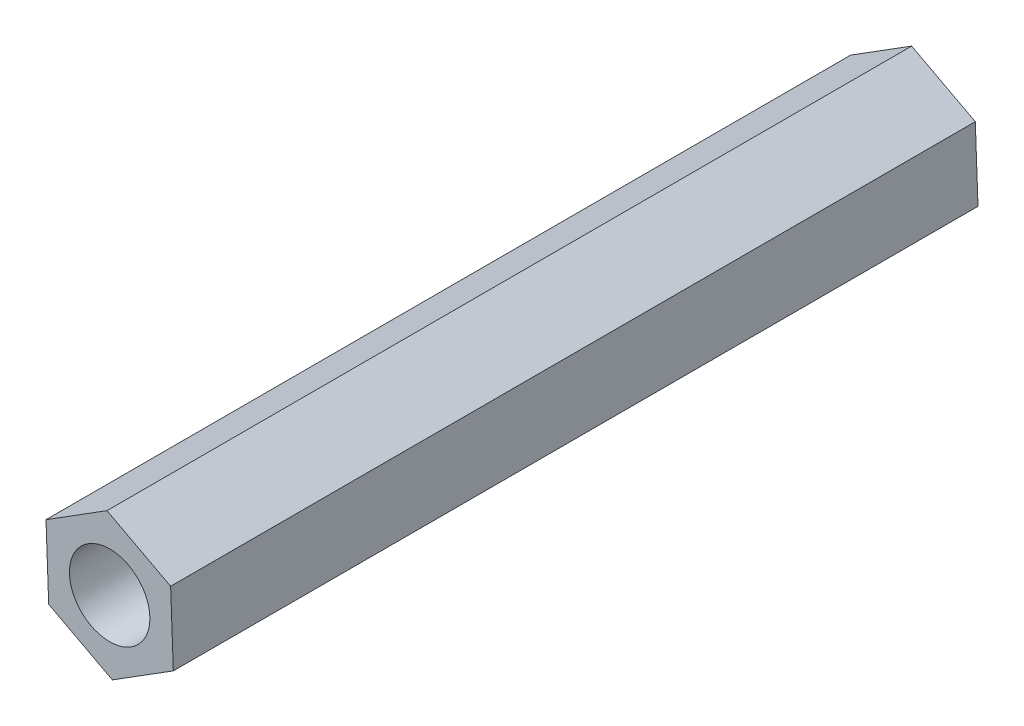
ISO-10303-21;
HEADER;
FILE_DESCRIPTION(('STEP AP214'),'2;1');
FILE_NAME('part.step','',(''),(''),'','','');
FILE_SCHEMA(('AUTOMOTIVE_DESIGN { 1 0 10303 214 1 1 1 1 }'));
ENDSEC;
DATA;
#1=APPLICATION_CONTEXT('core data for automotive mechanical design processes');
#2=APPLICATION_PROTOCOL_DEFINITION('international standard','automotive_design',2000,#1);
#3=PRODUCT_CONTEXT('',#1,'mechanical');
#4=PRODUCT('Part','Part','',(#3));
#5=PRODUCT_RELATED_PRODUCT_CATEGORY('part','',(#4));
#6=PRODUCT_DEFINITION_FORMATION('','',#4);
#7=PRODUCT_DEFINITION_CONTEXT('part definition',#1,'design');
#8=PRODUCT_DEFINITION('design','',#6,#7);
#9=PRODUCT_DEFINITION_SHAPE('','',#8);
#10=(LENGTH_UNIT() NAMED_UNIT(*) SI_UNIT(.MILLI.,.METRE.));
#11=(NAMED_UNIT(*) PLANE_ANGLE_UNIT() SI_UNIT($,.RADIAN.));
#12=(NAMED_UNIT(*) SI_UNIT($,.STERADIAN.) SOLID_ANGLE_UNIT());
#13=UNCERTAINTY_MEASURE_WITH_UNIT(LENGTH_MEASURE(1.E-05),#10,'distance_accuracy_value','');
#14=(GEOMETRIC_REPRESENTATION_CONTEXT(3) GLOBAL_UNCERTAINTY_ASSIGNED_CONTEXT((#13)) GLOBAL_UNIT_ASSIGNED_CONTEXT((#10,
#11,#12)) REPRESENTATION_CONTEXT('',''));
#15=CARTESIAN_POINT('',(0.,0.,0.));
#16=DIRECTION('',(0.,0.,1.));
#17=DIRECTION('',(1.,0.,0.));
#18=AXIS2_PLACEMENT_3D('',#15,#16,#17);
#19=CARTESIAN_POINT('',(0.,0.,30.));
#20=DIRECTION('',(0.,0.,1.));
#21=DIRECTION('',(1.,0.,0.));
#22=AXIS2_PLACEMENT_3D('',#19,#20,#21);
#23=PLANE('',#22);
#24=DIRECTION('',(-0.0373746720524852,0.999301322869618,0.));
#25=VECTOR('',#24,1.);
#26=CARTESIAN_POINT('',(2.37354506962798,-1.25450540152072,30.));
#27=LINE('',#26,#25);
#28=CARTESIAN_POINT('',(2.37354506962798,-1.25450540152072,30.));
#29=VERTEX_POINT('',#28);
#30=CARTESIAN_POINT('',(2.27320608171573,1.42829762656477,30.));
#31=VERTEX_POINT('',#30);
#32=EDGE_CURVE('E131',#29,#31,#27,.T.);
#33=ORIENTED_EDGE('',*,*,#32,.T.);
#34=DIRECTION('',(-0.884107667666727,0.467283245979245,0.));
#35=VECTOR('',#34,1.);
#36=CARTESIAN_POINT('',(2.27320608171573,1.42829762656477,30.));
#37=LINE('',#36,#35);
#38=CARTESIAN_POINT('',(-0.100338987912251,2.68280302808549,30.));
#39=VERTEX_POINT('',#38);
#40=EDGE_CURVE('E89',#31,#39,#37,.T.);
#41=ORIENTED_EDGE('',*,*,#40,.T.);
#42=DIRECTION('',(-0.846732995614242,-0.532018076890375,0.));
#43=VECTOR('',#42,1.);
#44=CARTESIAN_POINT('',(-0.100338987912251,2.68280302808549,30.));
#45=LINE('',#44,#43);
#46=CARTESIAN_POINT('',(-2.37354506962798,1.25450540152072,30.));
#47=VERTEX_POINT('',#46);
#48=EDGE_CURVE('E102',#39,#47,#45,.T.);
#49=ORIENTED_EDGE('',*,*,#48,.T.);
#50=DIRECTION('',(0.0373746720524864,-0.999301322869618,0.));
#51=VECTOR('',#50,1.);
#52=CARTESIAN_POINT('',(-2.37354506962798,1.25450540152072,30.));
#53=LINE('',#52,#51);
#54=CARTESIAN_POINT('',(-2.27320608171573,-1.42829762656478,30.));
#55=VERTEX_POINT('',#54);
#56=EDGE_CURVE('E96',#47,#55,#53,.T.);
#57=ORIENTED_EDGE('',*,*,#56,.T.);
#58=DIRECTION('',(0.884107667666728,-0.467283245979244,0.));
#59=VECTOR('',#58,1.);
#60=CARTESIAN_POINT('',(-2.27320608171573,-1.42829762656478,30.));
#61=LINE('',#60,#59);
#62=CARTESIAN_POINT('',(0.100338987912251,-2.68280302808549,30.));
#63=VERTEX_POINT('',#62);
#64=EDGE_CURVE('E100',#55,#63,#61,.T.);
#65=ORIENTED_EDGE('',*,*,#64,.T.);
#66=DIRECTION('',(0.846732995614242,0.532018076890374,0.));
#67=VECTOR('',#66,1.);
#68=CARTESIAN_POINT('',(0.100338987912251,-2.68280302808549,30.));
#69=LINE('',#68,#67);
#70=EDGE_CURVE('E52',#63,#29,#69,.T.);
#71=ORIENTED_EDGE('',*,*,#70,.T.);
#72=EDGE_LOOP('',(#33,#41,#49,#57,#65,#71));
#73=FACE_BOUND('',#72,.T.);
#74=CARTESIAN_POINT('',(0.,0.,30.));
#75=DIRECTION('',(0.,0.,1.));
#76=DIRECTION('',(1.,0.,0.));
#77=AXIS2_PLACEMENT_3D('',#74,#75,#76);
#78=CIRCLE('',#77,1.5);
#79=CARTESIAN_POINT('',(1.5,0.,30.));
#80=VERTEX_POINT('',#79);
#81=EDGE_CURVE('E124',#80,#80,#78,.T.);
#82=ORIENTED_EDGE('',*,*,#81,.F.);
#83=EDGE_LOOP('',(#82));
#84=FACE_BOUND('',#83,.T.);
#85=ADVANCED_FACE('F35',(#73,#84),#23,.T.);
#86=CARTESIAN_POINT('',(0.,0.,0.));
#87=DIRECTION('',(0.,0.,1.));
#88=DIRECTION('',(1.,0.,0.));
#89=AXIS2_PLACEMENT_3D('',#86,#87,#88);
#90=PLANE('',#89);
#91=DIRECTION('',(-0.0373746720524852,0.999301322869618,0.));
#92=VECTOR('',#91,1.);
#93=CARTESIAN_POINT('',(2.37354506962798,-1.25450540152072,0.));
#94=LINE('',#93,#92);
#95=CARTESIAN_POINT('',(2.37354506962798,-1.25450540152072,0.));
#96=VERTEX_POINT('',#95);
#97=CARTESIAN_POINT('',(2.27320608171573,1.42829762656477,0.));
#98=VERTEX_POINT('',#97);
#99=EDGE_CURVE('E120',#96,#98,#94,.T.);
#100=ORIENTED_EDGE('',*,*,#99,.F.);
#101=DIRECTION('',(0.846732995614242,0.532018076890374,0.));
#102=VECTOR('',#101,1.);
#103=CARTESIAN_POINT('',(0.100338987912251,-2.68280302808549,0.));
#104=LINE('',#103,#102);
#105=CARTESIAN_POINT('',(0.100338987912251,-2.68280302808549,0.));
#106=VERTEX_POINT('',#105);
#107=EDGE_CURVE('E81',#106,#96,#104,.T.);
#108=ORIENTED_EDGE('',*,*,#107,.F.);
#109=DIRECTION('',(0.884107667666728,-0.467283245979244,0.));
#110=VECTOR('',#109,1.);
#111=CARTESIAN_POINT('',(-2.27320608171573,-1.42829762656478,0.));
#112=LINE('',#111,#110);
#113=CARTESIAN_POINT('',(-2.27320608171573,-1.42829762656478,0.));
#114=VERTEX_POINT('',#113);
#115=EDGE_CURVE('E75',#114,#106,#112,.T.);
#116=ORIENTED_EDGE('',*,*,#115,.F.);
#117=DIRECTION('',(0.0373746720524864,-0.999301322869618,0.));
#118=VECTOR('',#117,1.);
#119=CARTESIAN_POINT('',(-2.37354506962798,1.25450540152072,0.));
#120=LINE('',#119,#118);
#121=CARTESIAN_POINT('',(-2.37354506962798,1.25450540152072,0.));
#122=VERTEX_POINT('',#121);
#123=EDGE_CURVE('E110',#122,#114,#120,.T.);
#124=ORIENTED_EDGE('',*,*,#123,.F.);
#125=DIRECTION('',(-0.846732995614242,-0.532018076890375,0.));
#126=VECTOR('',#125,1.);
#127=CARTESIAN_POINT('',(-0.100338987912251,2.68280302808549,0.));
#128=LINE('',#127,#126);
#129=CARTESIAN_POINT('',(-0.100338987912251,2.68280302808549,0.));
#130=VERTEX_POINT('',#129);
#131=EDGE_CURVE('E126',#130,#122,#128,.T.);
#132=ORIENTED_EDGE('',*,*,#131,.F.);
#133=DIRECTION('',(-0.884107667666727,0.467283245979245,0.));
#134=VECTOR('',#133,1.);
#135=CARTESIAN_POINT('',(2.27320608171573,1.42829762656477,0.));
#136=LINE('',#135,#134);
#137=EDGE_CURVE('E123',#98,#130,#136,.T.);
#138=ORIENTED_EDGE('',*,*,#137,.F.);
#139=EDGE_LOOP('',(#100,#108,#116,#124,#132,#138));
#140=FACE_BOUND('',#139,.T.);
#141=CARTESIAN_POINT('',(0.,0.,0.));
#142=DIRECTION('',(0.,0.,1.));
#143=DIRECTION('',(1.,0.,0.));
#144=AXIS2_PLACEMENT_3D('',#141,#142,#143);
#145=CIRCLE('',#144,1.5);
#146=CARTESIAN_POINT('',(1.5,0.,0.));
#147=VERTEX_POINT('',#146);
#148=EDGE_CURVE('E224',#147,#147,#145,.T.);
#149=ORIENTED_EDGE('',*,*,#148,.T.);
#150=EDGE_LOOP('',(#149));
#151=FACE_BOUND('',#150,.T.);
#152=ADVANCED_FACE('F140',(#140,#151),#90,.F.);
#153=CARTESIAN_POINT('',(2.37354506962798,-1.25450540152072,30.));
#154=DIRECTION('',(-0.999301322869618,-0.0373746720524852,0.));
#155=DIRECTION('',(0.0373746720524852,-0.999301322869618,0.));
#156=AXIS2_PLACEMENT_3D('',#153,#154,#155);
#157=PLANE('',#156);
#158=ORIENTED_EDGE('',*,*,#99,.T.);
#159=DIRECTION('',(0.,0.,-1.));
#160=VECTOR('',#159,1.);
#161=CARTESIAN_POINT('',(2.27320608171573,1.42829762656477,30.));
#162=LINE('',#161,#160);
#163=EDGE_CURVE('E11',#31,#98,#162,.T.);
#164=ORIENTED_EDGE('',*,*,#163,.F.);
#165=ORIENTED_EDGE('',*,*,#32,.F.);
#166=DIRECTION('',(0.,0.,-1.));
#167=VECTOR('',#166,1.);
#168=CARTESIAN_POINT('',(2.37354506962798,-1.25450540152072,30.));
#169=LINE('',#168,#167);
#170=EDGE_CURVE('E116',#29,#96,#169,.T.);
#171=ORIENTED_EDGE('',*,*,#170,.T.);
#172=EDGE_LOOP('',(#158,#164,#165,#171));
#173=FACE_BOUND('',#172,.T.);
#174=ADVANCED_FACE('F37',(#173),#157,.F.);
#175=CARTESIAN_POINT('',(2.27320608171573,1.42829762656477,30.));
#176=DIRECTION('',(-0.467283245979245,-0.884107667666727,0.));
#177=DIRECTION('',(0.884107667666727,-0.467283245979245,0.));
#178=AXIS2_PLACEMENT_3D('',#175,#176,#177);
#179=PLANE('',#178);
#180=ORIENTED_EDGE('',*,*,#137,.T.);
#181=DIRECTION('',(0.,0.,-1.));
#182=VECTOR('',#181,1.);
#183=CARTESIAN_POINT('',(-0.100338987912251,2.68280302808549,30.));
#184=LINE('',#183,#182);
#185=EDGE_CURVE('E44',#39,#130,#184,.T.);
#186=ORIENTED_EDGE('',*,*,#185,.F.);
#187=ORIENTED_EDGE('',*,*,#40,.F.);
#188=ORIENTED_EDGE('',*,*,#163,.T.);
#189=EDGE_LOOP('',(#180,#186,#187,#188));
#190=FACE_BOUND('',#189,.T.);
#191=ADVANCED_FACE('F165',(#190),#179,.F.);
#192=CARTESIAN_POINT('',(-0.100338987912251,2.68280302808549,30.));
#193=DIRECTION('',(0.532018076890375,-0.846732995614242,0.));
#194=DIRECTION('',(0.846732995614242,0.532018076890375,0.));
#195=AXIS2_PLACEMENT_3D('',#192,#193,#194);
#196=PLANE('',#195);
#197=ORIENTED_EDGE('',*,*,#131,.T.);
#198=DIRECTION('',(0.,0.,-1.));
#199=VECTOR('',#198,1.);
#200=CARTESIAN_POINT('',(-2.37354506962798,1.25450540152072,30.));
#201=LINE('',#200,#199);
#202=EDGE_CURVE('E111',#47,#122,#201,.T.);
#203=ORIENTED_EDGE('',*,*,#202,.F.);
#204=ORIENTED_EDGE('',*,*,#48,.F.);
#205=ORIENTED_EDGE('',*,*,#185,.T.);
#206=EDGE_LOOP('',(#197,#203,#204,#205));
#207=FACE_BOUND('',#206,.T.);
#208=ADVANCED_FACE('F137',(#207),#196,.F.);
#209=CARTESIAN_POINT('',(-2.37354506962798,1.25450540152072,30.));
#210=DIRECTION('',(0.999301322869618,0.0373746720524864,0.));
#211=DIRECTION('',(-0.0373746720524864,0.999301322869618,0.));
#212=AXIS2_PLACEMENT_3D('',#209,#210,#211);
#213=PLANE('',#212);
#214=ORIENTED_EDGE('',*,*,#123,.T.);
#215=DIRECTION('',(0.,0.,-1.));
#216=VECTOR('',#215,1.);
#217=CARTESIAN_POINT('',(-2.27320608171573,-1.42829762656478,30.));
#218=LINE('',#217,#216);
#219=EDGE_CURVE('E107',#55,#114,#218,.T.);
#220=ORIENTED_EDGE('',*,*,#219,.F.);
#221=ORIENTED_EDGE('',*,*,#56,.F.);
#222=ORIENTED_EDGE('',*,*,#202,.T.);
#223=EDGE_LOOP('',(#214,#220,#221,#222));
#224=FACE_BOUND('',#223,.T.);
#225=ADVANCED_FACE('F108',(#224),#213,.F.);
#226=CARTESIAN_POINT('',(-2.27320608171573,-1.42829762656478,30.));
#227=DIRECTION('',(0.467283245979244,0.884107667666728,0.));
#228=DIRECTION('',(-0.884107667666728,0.467283245979244,0.));
#229=AXIS2_PLACEMENT_3D('',#226,#227,#228);
#230=PLANE('',#229);
#231=ORIENTED_EDGE('',*,*,#115,.T.);
#232=DIRECTION('',(0.,0.,-1.));
#233=VECTOR('',#232,1.);
#234=CARTESIAN_POINT('',(0.100338987912251,-2.68280302808549,30.));
#235=LINE('',#234,#233);
#236=EDGE_CURVE('E112',#63,#106,#235,.T.);
#237=ORIENTED_EDGE('',*,*,#236,.F.);
#238=ORIENTED_EDGE('',*,*,#64,.F.);
#239=ORIENTED_EDGE('',*,*,#219,.T.);
#240=EDGE_LOOP('',(#231,#237,#238,#239));
#241=FACE_BOUND('',#240,.T.);
#242=ADVANCED_FACE('F114',(#241),#230,.F.);
#243=CARTESIAN_POINT('',(0.100338987912251,-2.68280302808549,30.));
#244=DIRECTION('',(-0.532018076890374,0.846732995614242,0.));
#245=DIRECTION('',(-0.846732995614242,-0.532018076890375,0.));
#246=AXIS2_PLACEMENT_3D('',#243,#244,#245);
#247=PLANE('',#246);
#248=ORIENTED_EDGE('',*,*,#107,.T.);
#249=ORIENTED_EDGE('',*,*,#170,.F.);
#250=ORIENTED_EDGE('',*,*,#70,.F.);
#251=ORIENTED_EDGE('',*,*,#236,.T.);
#252=EDGE_LOOP('',(#248,#249,#250,#251));
#253=FACE_BOUND('',#252,.T.);
#254=ADVANCED_FACE('F145',(#253),#247,.F.);
#255=CARTESIAN_POINT('',(0.,0.,30.));
#256=DIRECTION('',(0.,0.,-1.));
#257=DIRECTION('',(-1.,0.,0.));
#258=AXIS2_PLACEMENT_3D('',#255,#256,#257);
#259=CYLINDRICAL_SURFACE('',#258,1.5);
#260=ORIENTED_EDGE('',*,*,#81,.T.);
#261=EDGE_LOOP('',(#260));
#262=FACE_BOUND('',#261,.T.);
#263=ORIENTED_EDGE('',*,*,#148,.F.);
#264=EDGE_LOOP('',(#263));
#265=FACE_BOUND('',#264,.T.);
#266=ADVANCED_FACE('F147',(#262,#265),#259,.F.);
#267=CLOSED_SHELL('',(#85,#152,#174,#191,#208,#225,#242,#254,#266));
#268=MANIFOLD_SOLID_BREP('B2',#267);
#269=ADVANCED_BREP_SHAPE_REPRESENTATION('',(#18,#268),#14);
#270=SHAPE_DEFINITION_REPRESENTATION(#9,#269);
ENDSEC;
END-ISO-10303-21;
